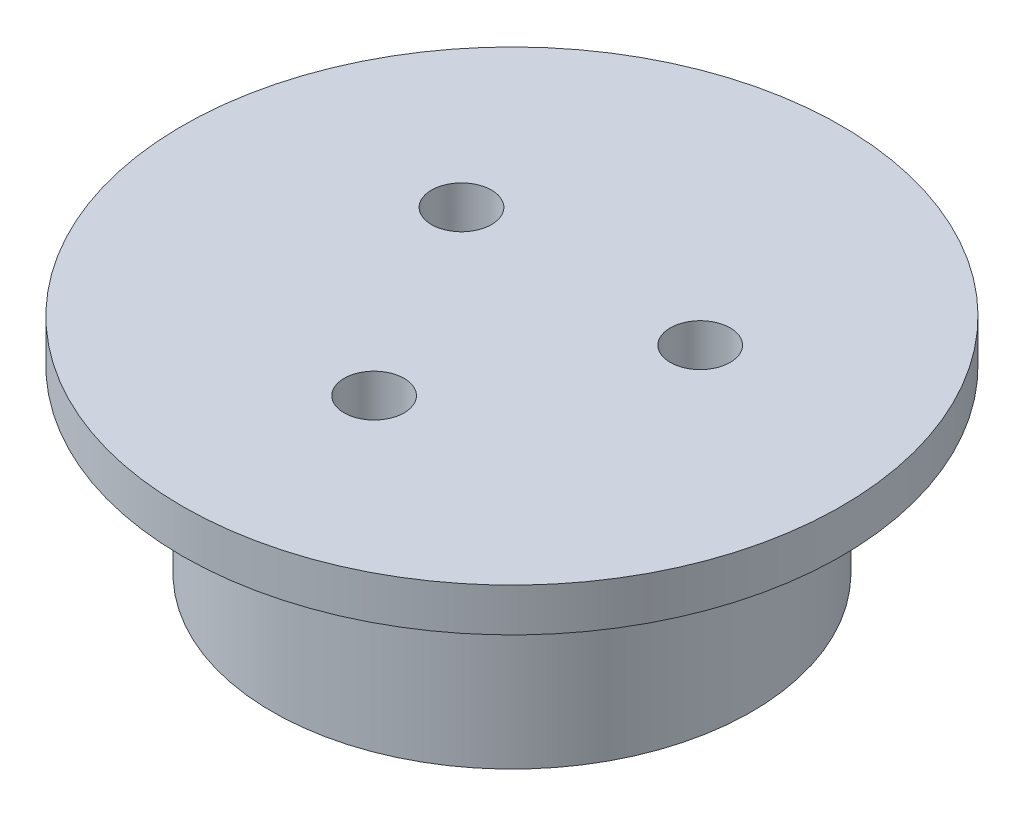
ISO-10303-21;
HEADER;
FILE_DESCRIPTION(('STEP AP214'),'2;1');
FILE_NAME('part.step','',(''),(''),'','','');
FILE_SCHEMA(('AUTOMOTIVE_DESIGN { 1 0 10303 214 1 1 1 1 }'));
ENDSEC;
DATA;
#1=APPLICATION_CONTEXT('core data for automotive mechanical design processes');
#2=APPLICATION_PROTOCOL_DEFINITION('international standard','automotive_design',2000,#1);
#3=PRODUCT_CONTEXT('',#1,'mechanical');
#4=PRODUCT('Part','Part','',(#3));
#5=PRODUCT_RELATED_PRODUCT_CATEGORY('part','',(#4));
#6=PRODUCT_DEFINITION_FORMATION('','',#4);
#7=PRODUCT_DEFINITION_CONTEXT('part definition',#1,'design');
#8=PRODUCT_DEFINITION('design','',#6,#7);
#9=PRODUCT_DEFINITION_SHAPE('','',#8);
#10=(LENGTH_UNIT() NAMED_UNIT(*) SI_UNIT(.MILLI.,.METRE.));
#11=(NAMED_UNIT(*) PLANE_ANGLE_UNIT() SI_UNIT($,.RADIAN.));
#12=(NAMED_UNIT(*) SI_UNIT($,.STERADIAN.) SOLID_ANGLE_UNIT());
#13=UNCERTAINTY_MEASURE_WITH_UNIT(LENGTH_MEASURE(1.E-05),#10,'distance_accuracy_value','');
#14=(GEOMETRIC_REPRESENTATION_CONTEXT(3) GLOBAL_UNCERTAINTY_ASSIGNED_CONTEXT((#13)) GLOBAL_UNIT_ASSIGNED_CONTEXT((#10,
#11,#12)) REPRESENTATION_CONTEXT('',''));
#15=CARTESIAN_POINT('',(0.,0.,0.));
#16=DIRECTION('',(0.,0.,1.));
#17=DIRECTION('',(1.,0.,0.));
#18=AXIS2_PLACEMENT_3D('',#15,#16,#17);
#19=CARTESIAN_POINT('',(-9.9592921435211,3.6,-5.7499999999999));
#20=DIRECTION('',(0.,-1.,0.));
#21=DIRECTION('',(0.,0.,-1.));
#22=AXIS2_PLACEMENT_3D('',#19,#20,#21);
#23=CYLINDRICAL_SURFACE('',#22,2.5);
#24=CARTESIAN_POINT('',(-9.9592921435211,3.6,-5.7499999999999));
#25=DIRECTION('',(0.,1.,0.));
#26=DIRECTION('',(0.,0.,1.));
#27=AXIS2_PLACEMENT_3D('',#24,#25,#26);
#28=CIRCLE('',#27,2.5);
#29=CARTESIAN_POINT('',(-9.9592921435211,3.6,-3.2499999999999));
#30=VERTEX_POINT('',#29);
#31=EDGE_CURVE('E56',#30,#30,#28,.T.);
#32=ORIENTED_EDGE('',*,*,#31,.T.);
#33=EDGE_LOOP('',(#32));
#34=FACE_BOUND('',#33,.T.);
#35=CARTESIAN_POINT('',(-9.9592921435211,-10.,-5.7499999999999));
#36=DIRECTION('',(0.,-1.,0.));
#37=DIRECTION('',(0.,0.,-1.));
#38=AXIS2_PLACEMENT_3D('',#35,#36,#37);
#39=CIRCLE('',#38,2.5);
#40=CARTESIAN_POINT('',(-9.9592921435211,-10.,-8.2499999999999));
#41=VERTEX_POINT('',#40);
#42=EDGE_CURVE('E108',#41,#41,#39,.T.);
#43=ORIENTED_EDGE('',*,*,#42,.T.);
#44=EDGE_LOOP('',(#43));
#45=FACE_BOUND('',#44,.T.);
#46=ADVANCED_FACE('F31',(#34,#45),#23,.F.);
#47=CARTESIAN_POINT('',(9.95929214352102,3.6,-5.75000000000005));
#48=DIRECTION('',(0.,-1.,0.));
#49=DIRECTION('',(0.,0.,-1.));
#50=AXIS2_PLACEMENT_3D('',#47,#48,#49);
#51=CYLINDRICAL_SURFACE('',#50,2.5);
#52=CARTESIAN_POINT('',(9.95929214352102,3.6,-5.75000000000005));
#53=DIRECTION('',(0.,1.,0.));
#54=DIRECTION('',(0.,0.,1.));
#55=AXIS2_PLACEMENT_3D('',#52,#53,#54);
#56=CIRCLE('',#55,2.5);
#57=CARTESIAN_POINT('',(9.95929214352102,3.6,-3.25000000000005));
#58=VERTEX_POINT('',#57);
#59=EDGE_CURVE('E53',#58,#58,#56,.T.);
#60=ORIENTED_EDGE('',*,*,#59,.T.);
#61=EDGE_LOOP('',(#60));
#62=FACE_BOUND('',#61,.T.);
#63=CARTESIAN_POINT('',(9.95929214352102,-10.,-5.75000000000005));
#64=DIRECTION('',(0.,-1.,0.));
#65=DIRECTION('',(0.,0.,-1.));
#66=AXIS2_PLACEMENT_3D('',#63,#64,#65);
#67=CIRCLE('',#66,2.5);
#68=CARTESIAN_POINT('',(9.95929214352102,-10.,-8.25000000000005));
#69=VERTEX_POINT('',#68);
#70=EDGE_CURVE('E112',#69,#69,#67,.T.);
#71=ORIENTED_EDGE('',*,*,#70,.T.);
#72=EDGE_LOOP('',(#71));
#73=FACE_BOUND('',#72,.T.);
#74=ADVANCED_FACE('F76',(#62,#73),#51,.F.);
#75=CARTESIAN_POINT('',(0.,3.6,11.5));
#76=DIRECTION('',(0.,-1.,0.));
#77=DIRECTION('',(0.,0.,-1.));
#78=AXIS2_PLACEMENT_3D('',#75,#76,#77);
#79=CYLINDRICAL_SURFACE('',#78,2.5);
#80=CARTESIAN_POINT('',(0.,3.6,11.5));
#81=DIRECTION('',(0.,1.,0.));
#82=DIRECTION('',(0.,0.,1.));
#83=AXIS2_PLACEMENT_3D('',#80,#81,#82);
#84=CIRCLE('',#83,2.5);
#85=CARTESIAN_POINT('',(0.,3.6,14.));
#86=VERTEX_POINT('',#85);
#87=EDGE_CURVE('E50',#86,#86,#84,.T.);
#88=ORIENTED_EDGE('',*,*,#87,.T.);
#89=EDGE_LOOP('',(#88));
#90=FACE_BOUND('',#89,.T.);
#91=CARTESIAN_POINT('',(0.,-10.,11.5));
#92=DIRECTION('',(0.,-1.,0.));
#93=DIRECTION('',(0.,0.,-1.));
#94=AXIS2_PLACEMENT_3D('',#91,#92,#93);
#95=CIRCLE('',#94,2.5);
#96=CARTESIAN_POINT('',(0.,-10.,9.));
#97=VERTEX_POINT('',#96);
#98=EDGE_CURVE('E35',#97,#97,#95,.T.);
#99=ORIENTED_EDGE('',*,*,#98,.T.);
#100=EDGE_LOOP('',(#99));
#101=FACE_BOUND('',#100,.T.);
#102=ADVANCED_FACE('F72',(#90,#101),#79,.F.);
#103=CARTESIAN_POINT('',(0.,3.6,0.));
#104=DIRECTION('',(0.,1.,0.));
#105=DIRECTION('',(0.,0.,1.));
#106=AXIS2_PLACEMENT_3D('',#103,#104,#105);
#107=PLANE('',#106);
#108=ORIENTED_EDGE('',*,*,#59,.F.);
#109=EDGE_LOOP('',(#108));
#110=FACE_BOUND('',#109,.T.);
#111=CARTESIAN_POINT('',(0.,3.6,0.));
#112=DIRECTION('',(0.,1.,0.));
#113=DIRECTION('',(0.,0.,1.));
#114=AXIS2_PLACEMENT_3D('',#111,#112,#113);
#115=CIRCLE('',#114,27.5);
#116=CARTESIAN_POINT('',(0.,3.6,27.5));
#117=VERTEX_POINT('',#116);
#118=EDGE_CURVE('E39',#117,#117,#115,.T.);
#119=ORIENTED_EDGE('',*,*,#118,.T.);
#120=EDGE_LOOP('',(#119));
#121=FACE_BOUND('',#120,.T.);
#122=ORIENTED_EDGE('',*,*,#31,.F.);
#123=EDGE_LOOP('',(#122));
#124=FACE_BOUND('',#123,.T.);
#125=ORIENTED_EDGE('',*,*,#87,.F.);
#126=EDGE_LOOP('',(#125));
#127=FACE_BOUND('',#126,.T.);
#128=ADVANCED_FACE('F64',(#110,#121,#124,#127),#107,.T.);
#129=CARTESIAN_POINT('',(0.,0.,0.));
#130=DIRECTION('',(0.,1.,0.));
#131=DIRECTION('',(0.,0.,1.));
#132=AXIS2_PLACEMENT_3D('',#129,#130,#131);
#133=PLANE('',#132);
#134=CARTESIAN_POINT('',(0.,0.,0.));
#135=DIRECTION('',(0.,-1.,0.));
#136=DIRECTION('',(0.,0.,-1.));
#137=AXIS2_PLACEMENT_3D('',#134,#135,#136);
#138=CIRCLE('',#137,20.);
#139=CARTESIAN_POINT('',(0.,0.,-20.));
#140=VERTEX_POINT('',#139);
#141=EDGE_CURVE('E10',#140,#140,#138,.T.);
#142=ORIENTED_EDGE('',*,*,#141,.F.);
#143=EDGE_LOOP('',(#142));
#144=FACE_BOUND('',#143,.T.);
#145=CARTESIAN_POINT('',(0.,0.,0.));
#146=DIRECTION('',(0.,1.,0.));
#147=DIRECTION('',(0.,0.,1.));
#148=AXIS2_PLACEMENT_3D('',#145,#146,#147);
#149=CIRCLE('',#148,27.5);
#150=CARTESIAN_POINT('',(0.,0.,27.5));
#151=VERTEX_POINT('',#150);
#152=EDGE_CURVE('E44',#151,#151,#149,.T.);
#153=ORIENTED_EDGE('',*,*,#152,.F.);
#154=EDGE_LOOP('',(#153));
#155=FACE_BOUND('',#154,.T.);
#156=ADVANCED_FACE('F62',(#144,#155),#133,.F.);
#157=CARTESIAN_POINT('',(0.,3.6,0.));
#158=DIRECTION('',(0.,-1.,0.));
#159=DIRECTION('',(0.,0.,-1.));
#160=AXIS2_PLACEMENT_3D('',#157,#158,#159);
#161=CYLINDRICAL_SURFACE('',#160,27.5);
#162=ORIENTED_EDGE('',*,*,#118,.F.);
#163=EDGE_LOOP('',(#162));
#164=FACE_BOUND('',#163,.T.);
#165=ORIENTED_EDGE('',*,*,#152,.T.);
#166=EDGE_LOOP('',(#165));
#167=FACE_BOUND('',#166,.T.);
#168=ADVANCED_FACE('F33',(#164,#167),#161,.T.);
#169=CARTESIAN_POINT('',(0.,-15.,0.));
#170=DIRECTION('',(0.,-1.,0.));
#171=DIRECTION('',(0.,0.,-1.));
#172=AXIS2_PLACEMENT_3D('',#169,#170,#171);
#173=PLANE('',#172);
#174=CARTESIAN_POINT('',(0.,-15.,0.));
#175=DIRECTION('',(0.,-1.,0.));
#176=DIRECTION('',(0.,0.,-1.));
#177=AXIS2_PLACEMENT_3D('',#174,#175,#176);
#178=CIRCLE('',#177,17.5);
#179=CARTESIAN_POINT('',(0.,-15.,-17.5));
#180=VERTEX_POINT('',#179);
#181=EDGE_CURVE('E119',#180,#180,#178,.T.);
#182=ORIENTED_EDGE('',*,*,#181,.F.);
#183=EDGE_LOOP('',(#182));
#184=FACE_BOUND('',#183,.T.);
#185=CARTESIAN_POINT('',(0.,-15.,0.));
#186=DIRECTION('',(0.,-1.,0.));
#187=DIRECTION('',(0.,0.,-1.));
#188=AXIS2_PLACEMENT_3D('',#185,#186,#187);
#189=CIRCLE('',#188,20.);
#190=CARTESIAN_POINT('',(0.,-15.,-20.));
#191=VERTEX_POINT('',#190);
#192=EDGE_CURVE('E48',#191,#191,#189,.T.);
#193=ORIENTED_EDGE('',*,*,#192,.T.);
#194=EDGE_LOOP('',(#193));
#195=FACE_BOUND('',#194,.T.);
#196=ADVANCED_FACE('F70',(#184,#195),#173,.T.);
#197=CARTESIAN_POINT('',(0.,-15.,0.));
#198=DIRECTION('',(0.,1.,0.));
#199=DIRECTION('',(0.,0.,1.));
#200=AXIS2_PLACEMENT_3D('',#197,#198,#199);
#201=CYLINDRICAL_SURFACE('',#200,20.);
#202=ORIENTED_EDGE('',*,*,#192,.F.);
#203=EDGE_LOOP('',(#202));
#204=FACE_BOUND('',#203,.T.);
#205=ORIENTED_EDGE('',*,*,#141,.T.);
#206=EDGE_LOOP('',(#205));
#207=FACE_BOUND('',#206,.T.);
#208=ADVANCED_FACE('F89',(#204,#207),#201,.T.);
#209=CARTESIAN_POINT('',(0.,-10.,0.));
#210=DIRECTION('',(0.,-1.,0.));
#211=DIRECTION('',(0.,0.,-1.));
#212=AXIS2_PLACEMENT_3D('',#209,#210,#211);
#213=CYLINDRICAL_SURFACE('',#212,17.5);
#214=CARTESIAN_POINT('',(0.,-10.,0.));
#215=DIRECTION('',(0.,-1.,0.));
#216=DIRECTION('',(0.,0.,-1.));
#217=AXIS2_PLACEMENT_3D('',#214,#215,#216);
#218=CIRCLE('',#217,17.5);
#219=CARTESIAN_POINT('',(0.,-10.,-17.5));
#220=VERTEX_POINT('',#219);
#221=EDGE_CURVE('E118',#220,#220,#218,.T.);
#222=ORIENTED_EDGE('',*,*,#221,.F.);
#223=EDGE_LOOP('',(#222));
#224=FACE_BOUND('',#223,.T.);
#225=ORIENTED_EDGE('',*,*,#181,.T.);
#226=EDGE_LOOP('',(#225));
#227=FACE_BOUND('',#226,.T.);
#228=ADVANCED_FACE('F92',(#224,#227),#213,.F.);
#229=CARTESIAN_POINT('',(0.,-10.,0.));
#230=DIRECTION('',(0.,-1.,0.));
#231=DIRECTION('',(0.,0.,-1.));
#232=AXIS2_PLACEMENT_3D('',#229,#230,#231);
#233=PLANE('',#232);
#234=ORIENTED_EDGE('',*,*,#42,.F.);
#235=EDGE_LOOP('',(#234));
#236=FACE_BOUND('',#235,.T.);
#237=ORIENTED_EDGE('',*,*,#70,.F.);
#238=EDGE_LOOP('',(#237));
#239=FACE_BOUND('',#238,.T.);
#240=ORIENTED_EDGE('',*,*,#98,.F.);
#241=EDGE_LOOP('',(#240));
#242=FACE_BOUND('',#241,.T.);
#243=ORIENTED_EDGE('',*,*,#221,.T.);
#244=EDGE_LOOP('',(#243));
#245=FACE_BOUND('',#244,.T.);
#246=ADVANCED_FACE('F99',(#236,#239,#242,#245),#233,.T.);
#247=CLOSED_SHELL('',(#46,#74,#102,#128,#156,#168,#196,#208,#228,#246));
#248=MANIFOLD_SOLID_BREP('B2',#247);
#249=ADVANCED_BREP_SHAPE_REPRESENTATION('',(#18,#248),#14);
#250=SHAPE_DEFINITION_REPRESENTATION(#9,#249);
ENDSEC;
END-ISO-10303-21;
